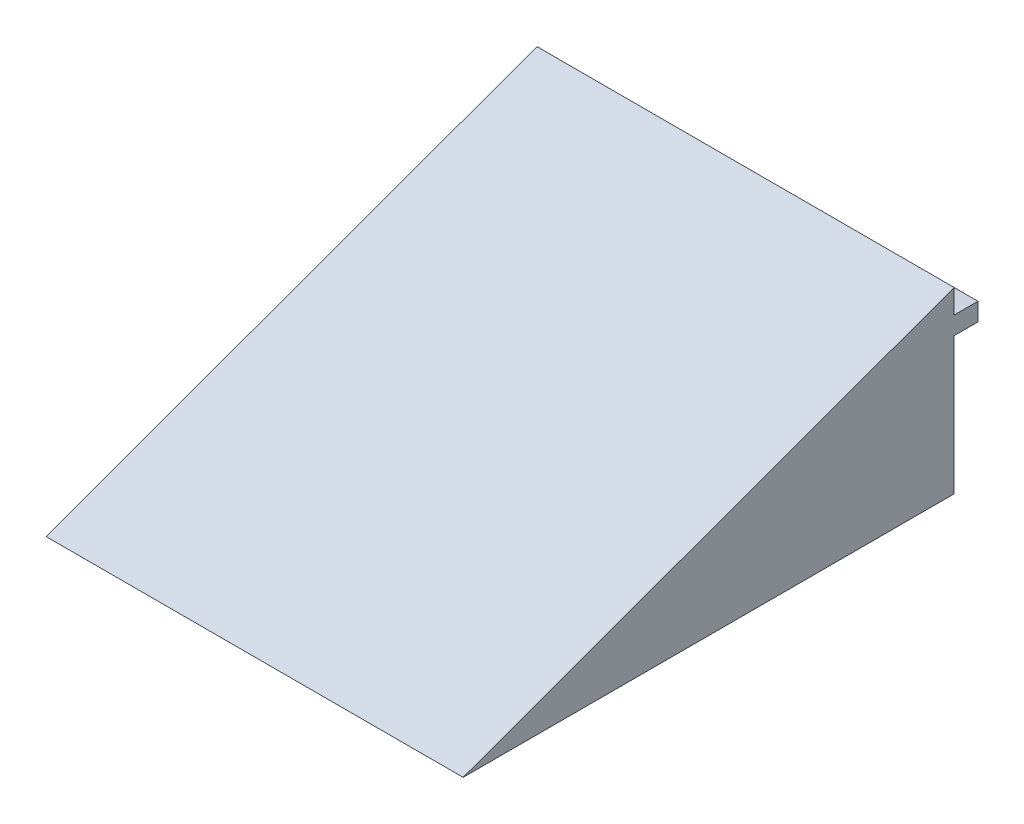
ISO-10303-21;
HEADER;
FILE_DESCRIPTION(('STEP AP214'),'2;1');
FILE_NAME('part.step','',(''),(''),'','','');
FILE_SCHEMA(('AUTOMOTIVE_DESIGN { 1 0 10303 214 1 1 1 1 }'));
ENDSEC;
DATA;
#1=APPLICATION_CONTEXT('core data for automotive mechanical design processes');
#2=APPLICATION_PROTOCOL_DEFINITION('international standard','automotive_design',2000,#1);
#3=PRODUCT_CONTEXT('',#1,'mechanical');
#4=PRODUCT('Part','Part','',(#3));
#5=PRODUCT_RELATED_PRODUCT_CATEGORY('part','',(#4));
#6=PRODUCT_DEFINITION_FORMATION('','',#4);
#7=PRODUCT_DEFINITION_CONTEXT('part definition',#1,'design');
#8=PRODUCT_DEFINITION('design','',#6,#7);
#9=PRODUCT_DEFINITION_SHAPE('','',#8);
#10=(LENGTH_UNIT() NAMED_UNIT(*) SI_UNIT(.MILLI.,.METRE.));
#11=(NAMED_UNIT(*) PLANE_ANGLE_UNIT() SI_UNIT($,.RADIAN.));
#12=(NAMED_UNIT(*) SI_UNIT($,.STERADIAN.) SOLID_ANGLE_UNIT());
#13=UNCERTAINTY_MEASURE_WITH_UNIT(LENGTH_MEASURE(1.E-05),#10,'distance_accuracy_value','');
#14=(GEOMETRIC_REPRESENTATION_CONTEXT(3) GLOBAL_UNCERTAINTY_ASSIGNED_CONTEXT((#13)) GLOBAL_UNIT_ASSIGNED_CONTEXT((#10,
#11,#12)) REPRESENTATION_CONTEXT('',''));
#15=CARTESIAN_POINT('',(0.,0.,0.));
#16=DIRECTION('',(0.,0.,1.));
#17=DIRECTION('',(1.,0.,0.));
#18=AXIS2_PLACEMENT_3D('',#15,#16,#17);
#19=CARTESIAN_POINT('',(-350.,0.,-412.));
#20=DIRECTION('',(0.,0.,-1.));
#21=DIRECTION('',(-1.,0.,0.));
#22=AXIS2_PLACEMENT_3D('',#19,#20,#21);
#23=PLANE('',#22);
#24=DIRECTION('',(1.,0.,0.));
#25=VECTOR('',#24,1.);
#26=CARTESIAN_POINT('',(0.,129.955736517673,-412.));
#27=LINE('',#26,#25);
#28=CARTESIAN_POINT('',(-350.,129.955736517673,-412.));
#29=VERTEX_POINT('',#28);
#30=CARTESIAN_POINT('',(0.,129.955736517673,-412.));
#31=VERTEX_POINT('',#30);
#32=EDGE_CURVE('E57',#29,#31,#27,.T.);
#33=ORIENTED_EDGE('',*,*,#32,.F.);
#34=DIRECTION('',(0.,1.,0.));
#35=VECTOR('',#34,1.);
#36=CARTESIAN_POINT('',(-350.,0.,-412.));
#37=LINE('',#36,#35);
#38=CARTESIAN_POINT('',(-350.,149.955736517673,-412.));
#39=VERTEX_POINT('',#38);
#40=EDGE_CURVE('E146',#29,#39,#37,.T.);
#41=ORIENTED_EDGE('',*,*,#40,.T.);
#42=DIRECTION('',(1.,0.,0.));
#43=VECTOR('',#42,1.);
#44=CARTESIAN_POINT('',(-350.,149.955736517673,-412.));
#45=LINE('',#44,#43);
#46=CARTESIAN_POINT('',(0.,149.955736517673,-412.));
#47=VERTEX_POINT('',#46);
#48=EDGE_CURVE('E11',#39,#47,#45,.T.);
#49=ORIENTED_EDGE('',*,*,#48,.T.);
#50=DIRECTION('',(0.,1.,0.));
#51=VECTOR('',#50,1.);
#52=CARTESIAN_POINT('',(0.,0.,-412.));
#53=LINE('',#52,#51);
#54=EDGE_CURVE('E61',#31,#47,#53,.T.);
#55=ORIENTED_EDGE('',*,*,#54,.F.);
#56=EDGE_LOOP('',(#33,#41,#49,#55));
#57=FACE_BOUND('',#56,.T.);
#58=ADVANCED_FACE('F39',(#57),#23,.T.);
#59=CARTESIAN_POINT('',(-350.,149.955736517673,-412.));
#60=DIRECTION('',(0.,0.93969262078591,0.342020143325663));
#61=DIRECTION('',(0.,-0.342020143325663,0.939692620785911));
#62=AXIS2_PLACEMENT_3D('',#59,#60,#61);
#63=PLANE('',#62);
#64=DIRECTION('',(0.,-0.342020143325663,0.939692620785911));
#65=VECTOR('',#64,1.);
#66=CARTESIAN_POINT('',(0.,149.955736517673,-412.));
#67=LINE('',#66,#65);
#68=CARTESIAN_POINT('',(0.,0.,0.));
#69=VERTEX_POINT('',#68);
#70=EDGE_CURVE('E128',#47,#69,#67,.T.);
#71=ORIENTED_EDGE('',*,*,#70,.F.);
#72=ORIENTED_EDGE('',*,*,#48,.F.);
#73=DIRECTION('',(0.,-0.342020143325663,0.939692620785911));
#74=VECTOR('',#73,1.);
#75=CARTESIAN_POINT('',(-350.,149.955736517673,-412.));
#76=LINE('',#75,#74);
#77=CARTESIAN_POINT('',(-350.,0.,0.));
#78=VERTEX_POINT('',#77);
#79=EDGE_CURVE('E138',#39,#78,#76,.T.);
#80=ORIENTED_EDGE('',*,*,#79,.T.);
#81=DIRECTION('',(1.,0.,0.));
#82=VECTOR('',#81,1.);
#83=CARTESIAN_POINT('',(-350.,0.,0.));
#84=LINE('',#83,#82);
#85=EDGE_CURVE('E43',#78,#69,#84,.T.);
#86=ORIENTED_EDGE('',*,*,#85,.T.);
#87=EDGE_LOOP('',(#71,#72,#80,#86));
#88=FACE_BOUND('',#87,.T.);
#89=ADVANCED_FACE('F41',(#88),#63,.T.);
#90=DIRECTION('',(-1.,0.,0.));
#91=VECTOR('',#90,1.);
#92=CARTESIAN_POINT('',(0.,114.955736517673,-412.));
#93=LINE('',#92,#91);
#94=CARTESIAN_POINT('',(0.,114.955736517673,-412.));
#95=VERTEX_POINT('',#94);
#96=CARTESIAN_POINT('',(-350.,114.955736517673,-412.));
#97=VERTEX_POINT('',#96);
#98=EDGE_CURVE('E172',#95,#97,#93,.T.);
#99=ORIENTED_EDGE('',*,*,#98,.F.);
#100=CARTESIAN_POINT('',(0.,0.,-412.));
#101=VERTEX_POINT('',#100);
#102=EDGE_CURVE('E126',#101,#95,#53,.T.);
#103=ORIENTED_EDGE('',*,*,#102,.F.);
#104=DIRECTION('',(1.,0.,0.));
#105=VECTOR('',#104,1.);
#106=CARTESIAN_POINT('',(-350.,0.,-412.));
#107=LINE('',#106,#105);
#108=CARTESIAN_POINT('',(-350.,0.,-412.));
#109=VERTEX_POINT('',#108);
#110=EDGE_CURVE('E49',#109,#101,#107,.T.);
#111=ORIENTED_EDGE('',*,*,#110,.F.);
#112=EDGE_CURVE('E147',#109,#97,#37,.T.);
#113=ORIENTED_EDGE('',*,*,#112,.T.);
#114=EDGE_LOOP('',(#99,#103,#111,#113));
#115=FACE_BOUND('',#114,.T.);
#116=ADVANCED_FACE('F171',(#115),#23,.T.);
#117=CARTESIAN_POINT('',(-350.,0.,0.));
#118=DIRECTION('',(0.,-1.,0.));
#119=DIRECTION('',(0.,0.,-1.));
#120=AXIS2_PLACEMENT_3D('',#117,#118,#119);
#121=PLANE('',#120);
#122=DIRECTION('',(0.,0.,-1.));
#123=VECTOR('',#122,1.);
#124=CARTESIAN_POINT('',(0.,0.,0.));
#125=LINE('',#124,#123);
#126=EDGE_CURVE('E132',#69,#101,#125,.T.);
#127=ORIENTED_EDGE('',*,*,#126,.F.);
#128=ORIENTED_EDGE('',*,*,#85,.F.);
#129=DIRECTION('',(0.,0.,-1.));
#130=VECTOR('',#129,1.);
#131=CARTESIAN_POINT('',(-350.,0.,0.));
#132=LINE('',#131,#130);
#133=EDGE_CURVE('E142',#78,#109,#132,.T.);
#134=ORIENTED_EDGE('',*,*,#133,.T.);
#135=ORIENTED_EDGE('',*,*,#110,.T.);
#136=EDGE_LOOP('',(#127,#128,#134,#135));
#137=FACE_BOUND('',#136,.T.);
#138=ADVANCED_FACE('F162',(#137),#121,.T.);
#139=CARTESIAN_POINT('',(-350.,0.,0.));
#140=DIRECTION('',(-1.,0.,0.));
#141=DIRECTION('',(0.,0.,1.));
#142=AXIS2_PLACEMENT_3D('',#139,#140,#141);
#143=PLANE('',#142);
#144=ORIENTED_EDGE('',*,*,#79,.F.);
#145=ORIENTED_EDGE('',*,*,#40,.F.);
#146=DIRECTION('',(0.,0.,1.));
#147=VECTOR('',#146,1.);
#148=CARTESIAN_POINT('',(-350.,129.955736517673,-432.));
#149=LINE('',#148,#147);
#150=CARTESIAN_POINT('',(-350.,129.955736517673,-432.));
#151=VERTEX_POINT('',#150);
#152=EDGE_CURVE('E134',#151,#29,#149,.T.);
#153=ORIENTED_EDGE('',*,*,#152,.F.);
#154=DIRECTION('',(0.,1.,0.));
#155=VECTOR('',#154,1.);
#156=CARTESIAN_POINT('',(-350.,129.955736517673,-432.));
#157=LINE('',#156,#155);
#158=CARTESIAN_POINT('',(-350.,114.955736517673,-432.));
#159=VERTEX_POINT('',#158);
#160=EDGE_CURVE('E109',#159,#151,#157,.T.);
#161=ORIENTED_EDGE('',*,*,#160,.F.);
#162=DIRECTION('',(0.,0.,1.));
#163=VECTOR('',#162,1.);
#164=CARTESIAN_POINT('',(-350.,114.955736517673,-432.));
#165=LINE('',#164,#163);
#166=EDGE_CURVE('E105',#159,#97,#165,.T.);
#167=ORIENTED_EDGE('',*,*,#166,.T.);
#168=ORIENTED_EDGE('',*,*,#112,.F.);
#169=ORIENTED_EDGE('',*,*,#133,.F.);
#170=EDGE_LOOP('',(#144,#145,#153,#161,#167,#168,#169));
#171=FACE_BOUND('',#170,.T.);
#172=ADVANCED_FACE('F166',(#171),#143,.T.);
#173=CARTESIAN_POINT('',(0.,0.,0.));
#174=DIRECTION('',(-1.,0.,0.));
#175=DIRECTION('',(0.,0.,1.));
#176=AXIS2_PLACEMENT_3D('',#173,#174,#175);
#177=PLANE('',#176);
#178=ORIENTED_EDGE('',*,*,#70,.T.);
#179=ORIENTED_EDGE('',*,*,#126,.T.);
#180=ORIENTED_EDGE('',*,*,#102,.T.);
#181=DIRECTION('',(0.,0.,1.));
#182=VECTOR('',#181,1.);
#183=CARTESIAN_POINT('',(0.,114.955736517673,-432.));
#184=LINE('',#183,#182);
#185=CARTESIAN_POINT('',(0.,114.955736517673,-432.));
#186=VERTEX_POINT('',#185);
#187=EDGE_CURVE('E103',#186,#95,#184,.T.);
#188=ORIENTED_EDGE('',*,*,#187,.F.);
#189=DIRECTION('',(0.,-1.,0.));
#190=VECTOR('',#189,1.);
#191=CARTESIAN_POINT('',(0.,129.955736517673,-432.));
#192=LINE('',#191,#190);
#193=CARTESIAN_POINT('',(0.,129.955736517673,-432.));
#194=VERTEX_POINT('',#193);
#195=EDGE_CURVE('E110',#194,#186,#192,.T.);
#196=ORIENTED_EDGE('',*,*,#195,.F.);
#197=DIRECTION('',(0.,0.,1.));
#198=VECTOR('',#197,1.);
#199=CARTESIAN_POINT('',(0.,129.955736517673,-432.));
#200=LINE('',#199,#198);
#201=EDGE_CURVE('E163',#194,#31,#200,.T.);
#202=ORIENTED_EDGE('',*,*,#201,.T.);
#203=ORIENTED_EDGE('',*,*,#54,.T.);
#204=EDGE_LOOP('',(#178,#179,#180,#188,#196,#202,#203));
#205=FACE_BOUND('',#204,.T.);
#206=ADVANCED_FACE('F123',(#205),#177,.F.);
#207=CARTESIAN_POINT('',(0.,114.955736517673,-432.));
#208=DIRECTION('',(0.,1.,0.));
#209=DIRECTION('',(0.,0.,1.));
#210=AXIS2_PLACEMENT_3D('',#207,#208,#209);
#211=PLANE('',#210);
#212=ORIENTED_EDGE('',*,*,#98,.T.);
#213=ORIENTED_EDGE('',*,*,#166,.F.);
#214=DIRECTION('',(-1.,0.,0.));
#215=VECTOR('',#214,1.);
#216=CARTESIAN_POINT('',(0.,114.955736517673,-432.));
#217=LINE('',#216,#215);
#218=EDGE_CURVE('E98',#186,#159,#217,.T.);
#219=ORIENTED_EDGE('',*,*,#218,.F.);
#220=ORIENTED_EDGE('',*,*,#187,.T.);
#221=EDGE_LOOP('',(#212,#213,#219,#220));
#222=FACE_BOUND('',#221,.T.);
#223=ADVANCED_FACE('F101',(#222),#211,.F.);
#224=CARTESIAN_POINT('',(0.,129.955736517673,-432.));
#225=DIRECTION('',(0.,-1.,0.));
#226=DIRECTION('',(0.,0.,-1.));
#227=AXIS2_PLACEMENT_3D('',#224,#225,#226);
#228=PLANE('',#227);
#229=ORIENTED_EDGE('',*,*,#32,.T.);
#230=ORIENTED_EDGE('',*,*,#201,.F.);
#231=DIRECTION('',(1.,0.,0.));
#232=VECTOR('',#231,1.);
#233=CARTESIAN_POINT('',(0.,129.955736517673,-432.));
#234=LINE('',#233,#232);
#235=EDGE_CURVE('E115',#151,#194,#234,.T.);
#236=ORIENTED_EDGE('',*,*,#235,.F.);
#237=ORIENTED_EDGE('',*,*,#152,.T.);
#238=EDGE_LOOP('',(#229,#230,#236,#237));
#239=FACE_BOUND('',#238,.T.);
#240=ADVANCED_FACE('F183',(#239),#228,.F.);
#241=CARTESIAN_POINT('',(0.,0.,-432.));
#242=DIRECTION('',(0.,0.,-1.));
#243=DIRECTION('',(-1.,0.,0.));
#244=AXIS2_PLACEMENT_3D('',#241,#242,#243);
#245=PLANE('',#244);
#246=ORIENTED_EDGE('',*,*,#195,.T.);
#247=ORIENTED_EDGE('',*,*,#218,.T.);
#248=ORIENTED_EDGE('',*,*,#160,.T.);
#249=ORIENTED_EDGE('',*,*,#235,.T.);
#250=EDGE_LOOP('',(#246,#247,#248,#249));
#251=FACE_BOUND('',#250,.T.);
#252=ADVANCED_FACE('F113',(#251),#245,.T.);
#253=CLOSED_SHELL('',(#58,#89,#116,#138,#172,#206,#223,#240,#252));
#254=MANIFOLD_SOLID_BREP('B2',#253);
#255=ADVANCED_BREP_SHAPE_REPRESENTATION('',(#18,#254),#14);
#256=SHAPE_DEFINITION_REPRESENTATION(#9,#255);
ENDSEC;
END-ISO-10303-21;
